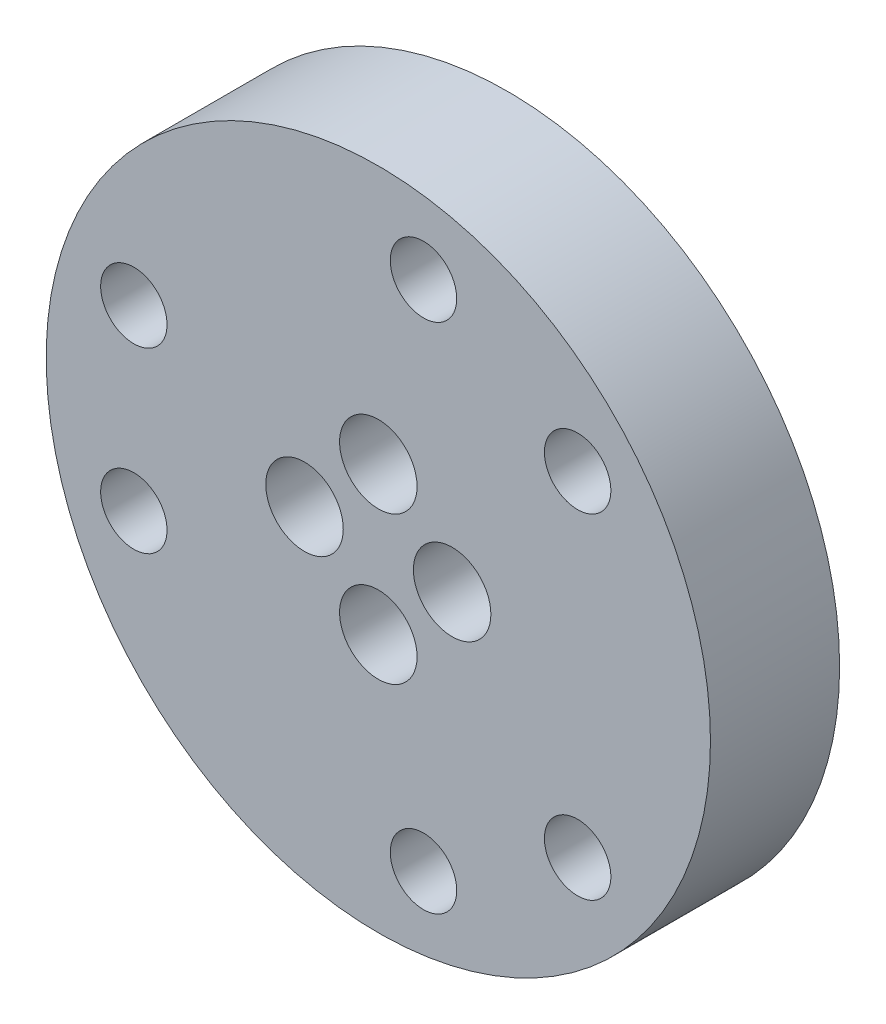
ISO-10303-21;
HEADER;
FILE_DESCRIPTION(('STEP AP214'),'2;1');
FILE_NAME('part.step','',(''),(''),'','','');
FILE_SCHEMA(('AUTOMOTIVE_DESIGN { 1 0 10303 214 1 1 1 1 }'));
ENDSEC;
DATA;
#1=APPLICATION_CONTEXT('core data for automotive mechanical design processes');
#2=APPLICATION_PROTOCOL_DEFINITION('international standard','automotive_design',2000,#1);
#3=PRODUCT_CONTEXT('',#1,'mechanical');
#4=PRODUCT('Part','Part','',(#3));
#5=PRODUCT_RELATED_PRODUCT_CATEGORY('part','',(#4));
#6=PRODUCT_DEFINITION_FORMATION('','',#4);
#7=PRODUCT_DEFINITION_CONTEXT('part definition',#1,'design');
#8=PRODUCT_DEFINITION('design','',#6,#7);
#9=PRODUCT_DEFINITION_SHAPE('','',#8);
#10=(LENGTH_UNIT() NAMED_UNIT(*) SI_UNIT(.MILLI.,.METRE.));
#11=(NAMED_UNIT(*) PLANE_ANGLE_UNIT() SI_UNIT($,.RADIAN.));
#12=(NAMED_UNIT(*) SI_UNIT($,.STERADIAN.) SOLID_ANGLE_UNIT());
#13=UNCERTAINTY_MEASURE_WITH_UNIT(LENGTH_MEASURE(1.E-05),#10,'distance_accuracy_value','');
#14=(GEOMETRIC_REPRESENTATION_CONTEXT(3) GLOBAL_UNCERTAINTY_ASSIGNED_CONTEXT((#13)) GLOBAL_UNIT_ASSIGNED_CONTEXT((#10,
#11,#12)) REPRESENTATION_CONTEXT('',''));
#15=CARTESIAN_POINT('',(0.,0.,0.));
#16=DIRECTION('',(0.,0.,1.));
#17=DIRECTION('',(1.,0.,0.));
#18=AXIS2_PLACEMENT_3D('',#15,#16,#17);
#19=CARTESIAN_POINT('',(0.,0.,0.));
#20=DIRECTION('',(0.,0.,1.));
#21=DIRECTION('',(1.,0.,0.));
#22=AXIS2_PLACEMENT_3D('',#19,#20,#21);
#23=PLANE('',#22);
#24=CARTESIAN_POINT('',(-13.2496659530813,4.82248402089194,0.));
#25=DIRECTION('',(0.,0.,-1.));
#26=DIRECTION('',(-1.,0.,0.));
#27=AXIS2_PLACEMENT_3D('',#24,#25,#26);
#28=CIRCLE('',#27,3.15);
#29=CARTESIAN_POINT('',(-16.3996659530813,4.82248402089194,0.));
#30=VERTEX_POINT('',#29);
#31=EDGE_CURVE('E203',#30,#30,#28,.T.);
#32=ORIENTED_EDGE('',*,*,#31,.F.);
#33=EDGE_LOOP('',(#32));
#34=FACE_BOUND('',#33,.T.);
#35=CARTESIAN_POINT('',(-4.,0.,0.));
#36=DIRECTION('',(0.,0.,1.));
#37=DIRECTION('',(1.,0.,0.));
#38=AXIS2_PLACEMENT_3D('',#35,#36,#37);
#39=CIRCLE('',#38,1.1);
#40=CARTESIAN_POINT('',(-2.9,0.,0.));
#41=VERTEX_POINT('',#40);
#42=EDGE_CURVE('E51',#41,#41,#39,.T.);
#43=ORIENTED_EDGE('',*,*,#42,.T.);
#44=EDGE_LOOP('',(#43));
#45=FACE_BOUND('',#44,.T.);
#46=CARTESIAN_POINT('',(0.,-4.,0.));
#47=DIRECTION('',(0.,0.,1.));
#48=DIRECTION('',(1.,0.,0.));
#49=AXIS2_PLACEMENT_3D('',#46,#47,#48);
#50=CIRCLE('',#49,1.1);
#51=CARTESIAN_POINT('',(1.1,-4.,0.));
#52=VERTEX_POINT('',#51);
#53=EDGE_CURVE('E74',#52,#52,#50,.T.);
#54=ORIENTED_EDGE('',*,*,#53,.T.);
#55=EDGE_LOOP('',(#54));
#56=FACE_BOUND('',#55,.T.);
#57=CARTESIAN_POINT('',(4.,0.,0.));
#58=DIRECTION('',(0.,0.,1.));
#59=DIRECTION('',(1.,0.,0.));
#60=AXIS2_PLACEMENT_3D('',#57,#58,#59);
#61=CIRCLE('',#60,1.1);
#62=CARTESIAN_POINT('',(5.1,0.,0.));
#63=VERTEX_POINT('',#62);
#64=EDGE_CURVE('E76',#63,#63,#61,.T.);
#65=ORIENTED_EDGE('',*,*,#64,.T.);
#66=EDGE_LOOP('',(#65));
#67=FACE_BOUND('',#66,.T.);
#68=CARTESIAN_POINT('',(0.,4.,0.));
#69=DIRECTION('',(0.,0.,1.));
#70=DIRECTION('',(1.,0.,0.));
#71=AXIS2_PLACEMENT_3D('',#68,#69,#70);
#72=CIRCLE('',#71,1.1);
#73=CARTESIAN_POINT('',(1.1,4.,0.));
#74=VERTEX_POINT('',#73);
#75=EDGE_CURVE('E43',#74,#74,#72,.T.);
#76=ORIENTED_EDGE('',*,*,#75,.T.);
#77=EDGE_LOOP('',(#76));
#78=FACE_BOUND('',#77,.T.);
#79=CARTESIAN_POINT('',(0.,0.,0.));
#80=DIRECTION('',(0.,0.,1.));
#81=DIRECTION('',(1.,0.,0.));
#82=AXIS2_PLACEMENT_3D('',#79,#80,#81);
#83=CIRCLE('',#82,18.);
#84=CARTESIAN_POINT('',(18.,0.,0.));
#85=VERTEX_POINT('',#84);
#86=EDGE_CURVE('E38',#85,#85,#83,.T.);
#87=ORIENTED_EDGE('',*,*,#86,.F.);
#88=EDGE_LOOP('',(#87));
#89=FACE_BOUND('',#88,.T.);
#90=CARTESIAN_POINT('',(10.8012266479773,9.06330529658191,0.));
#91=DIRECTION('',(0.,0.,-1.));
#92=DIRECTION('',(-1.,0.,0.));
#93=AXIS2_PLACEMENT_3D('',#90,#91,#92);
#94=CIRCLE('',#93,3.15);
#95=CARTESIAN_POINT('',(7.65122664797731,9.06330529658191,0.));
#96=VERTEX_POINT('',#95);
#97=EDGE_CURVE('E167',#96,#96,#94,.T.);
#98=ORIENTED_EDGE('',*,*,#97,.F.);
#99=EDGE_LOOP('',(#98));
#100=FACE_BOUND('',#99,.T.);
#101=CARTESIAN_POINT('',(10.8012266479789,-9.06330529657909,0.));
#102=DIRECTION('',(0.,0.,-1.));
#103=DIRECTION('',(-1.,0.,0.));
#104=AXIS2_PLACEMENT_3D('',#101,#102,#103);
#105=CIRCLE('',#104,3.15);
#106=CARTESIAN_POINT('',(7.65122664797894,-9.06330529657909,0.));
#107=VERTEX_POINT('',#106);
#108=EDGE_CURVE('E176',#107,#107,#105,.T.);
#109=ORIENTED_EDGE('',*,*,#108,.F.);
#110=EDGE_LOOP('',(#109));
#111=FACE_BOUND('',#110,.T.);
#112=CARTESIAN_POINT('',(2.44843930510505,-13.885789317471,0.));
#113=DIRECTION('',(0.,0.,-1.));
#114=DIRECTION('',(-1.,0.,0.));
#115=AXIS2_PLACEMENT_3D('',#112,#113,#114);
#116=CIRCLE('',#115,3.15);
#117=CARTESIAN_POINT('',(-0.701560694894948,-13.885789317471,0.));
#118=VERTEX_POINT('',#117);
#119=EDGE_CURVE('E185',#118,#118,#116,.T.);
#120=ORIENTED_EDGE('',*,*,#119,.F.);
#121=EDGE_LOOP('',(#120));
#122=FACE_BOUND('',#121,.T.);
#123=CARTESIAN_POINT('',(-13.2496659530813,-4.82248402089194,0.));
#124=DIRECTION('',(0.,0.,-1.));
#125=DIRECTION('',(-1.,0.,0.));
#126=AXIS2_PLACEMENT_3D('',#123,#124,#125);
#127=CIRCLE('',#126,3.15);
#128=CARTESIAN_POINT('',(-16.3996659530813,-4.82248402089194,0.));
#129=VERTEX_POINT('',#128);
#130=EDGE_CURVE('E194',#129,#129,#127,.T.);
#131=ORIENTED_EDGE('',*,*,#130,.F.);
#132=EDGE_LOOP('',(#131));
#133=FACE_BOUND('',#132,.T.);
#134=CARTESIAN_POINT('',(2.44843930510341,13.8857893174738,0.));
#135=DIRECTION('',(0.,0.,-1.));
#136=DIRECTION('',(-1.,0.,0.));
#137=AXIS2_PLACEMENT_3D('',#134,#135,#136);
#138=CIRCLE('',#137,3.15);
#139=CARTESIAN_POINT('',(-0.701560694896587,13.8857893174738,0.));
#140=VERTEX_POINT('',#139);
#141=EDGE_CURVE('E212',#140,#140,#138,.T.);
#142=ORIENTED_EDGE('',*,*,#141,.F.);
#143=EDGE_LOOP('',(#142));
#144=FACE_BOUND('',#143,.T.);
#145=ADVANCED_FACE('F30',(#34,#45,#56,#67,#78,#89,#100,#111,#122,#133,#144),#23,.F.);
#146=CARTESIAN_POINT('',(0.,0.,7.));
#147=DIRECTION('',(0.,0.,1.));
#148=DIRECTION('',(1.,0.,0.));
#149=AXIS2_PLACEMENT_3D('',#146,#147,#148);
#150=PLANE('',#149);
#151=CARTESIAN_POINT('',(2.44843930510341,13.8857893174738,7.00000000000001));
#152=DIRECTION('',(0.,0.,-1.));
#153=DIRECTION('',(-1.,0.,0.));
#154=AXIS2_PLACEMENT_3D('',#151,#152,#153);
#155=CIRCLE('',#154,1.79999999999999);
#156=CARTESIAN_POINT('',(0.648439305103426,13.8857893174738,7.00000000000001));
#157=VERTEX_POINT('',#156);
#158=EDGE_CURVE('E206',#157,#157,#155,.T.);
#159=ORIENTED_EDGE('',*,*,#158,.T.);
#160=EDGE_LOOP('',(#159));
#161=FACE_BOUND('',#160,.T.);
#162=CARTESIAN_POINT('',(0.,0.,7.));
#163=DIRECTION('',(0.,0.,1.));
#164=DIRECTION('',(1.,0.,0.));
#165=AXIS2_PLACEMENT_3D('',#162,#163,#164);
#166=CIRCLE('',#165,18.);
#167=CARTESIAN_POINT('',(18.,0.,7.));
#168=VERTEX_POINT('',#167);
#169=EDGE_CURVE('E10',#168,#168,#166,.T.);
#170=ORIENTED_EDGE('',*,*,#169,.T.);
#171=EDGE_LOOP('',(#170));
#172=FACE_BOUND('',#171,.T.);
#173=CARTESIAN_POINT('',(0.,4.,7.));
#174=DIRECTION('',(0.,0.,1.));
#175=DIRECTION('',(1.,0.,0.));
#176=AXIS2_PLACEMENT_3D('',#173,#174,#175);
#177=CIRCLE('',#176,2.1);
#178=CARTESIAN_POINT('',(2.1,4.,7.));
#179=VERTEX_POINT('',#178);
#180=EDGE_CURVE('E61',#179,#179,#177,.T.);
#181=ORIENTED_EDGE('',*,*,#180,.F.);
#182=EDGE_LOOP('',(#181));
#183=FACE_BOUND('',#182,.T.);
#184=CARTESIAN_POINT('',(0.,-4.,7.));
#185=DIRECTION('',(0.,0.,1.));
#186=DIRECTION('',(1.,0.,0.));
#187=AXIS2_PLACEMENT_3D('',#184,#185,#186);
#188=CIRCLE('',#187,2.1);
#189=CARTESIAN_POINT('',(2.1,-4.,7.));
#190=VERTEX_POINT('',#189);
#191=EDGE_CURVE('E154',#190,#190,#188,.T.);
#192=ORIENTED_EDGE('',*,*,#191,.F.);
#193=EDGE_LOOP('',(#192));
#194=FACE_BOUND('',#193,.T.);
#195=CARTESIAN_POINT('',(4.,0.,7.));
#196=DIRECTION('',(0.,0.,1.));
#197=DIRECTION('',(1.,0.,0.));
#198=AXIS2_PLACEMENT_3D('',#195,#196,#197);
#199=CIRCLE('',#198,2.1);
#200=CARTESIAN_POINT('',(6.1,0.,7.));
#201=VERTEX_POINT('',#200);
#202=EDGE_CURVE('E142',#201,#201,#199,.T.);
#203=ORIENTED_EDGE('',*,*,#202,.F.);
#204=EDGE_LOOP('',(#203));
#205=FACE_BOUND('',#204,.T.);
#206=CARTESIAN_POINT('',(-4.,0.,7.));
#207=DIRECTION('',(0.,0.,1.));
#208=DIRECTION('',(1.,0.,0.));
#209=AXIS2_PLACEMENT_3D('',#206,#207,#208);
#210=CIRCLE('',#209,2.1);
#211=CARTESIAN_POINT('',(-1.9,0.,7.));
#212=VERTEX_POINT('',#211);
#213=EDGE_CURVE('E143',#212,#212,#210,.T.);
#214=ORIENTED_EDGE('',*,*,#213,.F.);
#215=EDGE_LOOP('',(#214));
#216=FACE_BOUND('',#215,.T.);
#217=CARTESIAN_POINT('',(10.8012266479773,9.06330529658191,7.00000000000001));
#218=DIRECTION('',(0.,0.,-1.));
#219=DIRECTION('',(-1.,0.,0.));
#220=AXIS2_PLACEMENT_3D('',#217,#218,#219);
#221=CIRCLE('',#220,1.79999999999999);
#222=CARTESIAN_POINT('',(9.00122664797732,9.06330529658191,7.00000000000001));
#223=VERTEX_POINT('',#222);
#224=EDGE_CURVE('E149',#223,#223,#221,.T.);
#225=ORIENTED_EDGE('',*,*,#224,.T.);
#226=EDGE_LOOP('',(#225));
#227=FACE_BOUND('',#226,.T.);
#228=CARTESIAN_POINT('',(10.8012266479789,-9.06330529657909,7.00000000000001));
#229=DIRECTION('',(0.,0.,-1.));
#230=DIRECTION('',(-1.,0.,0.));
#231=AXIS2_PLACEMENT_3D('',#228,#229,#230);
#232=CIRCLE('',#231,1.79999999999999);
#233=CARTESIAN_POINT('',(9.00122664797895,-9.06330529657909,7.00000000000001));
#234=VERTEX_POINT('',#233);
#235=EDGE_CURVE('E170',#234,#234,#232,.T.);
#236=ORIENTED_EDGE('',*,*,#235,.T.);
#237=EDGE_LOOP('',(#236));
#238=FACE_BOUND('',#237,.T.);
#239=CARTESIAN_POINT('',(2.44843930510505,-13.885789317471,7.00000000000001));
#240=DIRECTION('',(0.,0.,-1.));
#241=DIRECTION('',(-1.,0.,0.));
#242=AXIS2_PLACEMENT_3D('',#239,#240,#241);
#243=CIRCLE('',#242,1.79999999999999);
#244=CARTESIAN_POINT('',(0.648439305105064,-13.885789317471,7.00000000000001));
#245=VERTEX_POINT('',#244);
#246=EDGE_CURVE('E179',#245,#245,#243,.T.);
#247=ORIENTED_EDGE('',*,*,#246,.T.);
#248=EDGE_LOOP('',(#247));
#249=FACE_BOUND('',#248,.T.);
#250=CARTESIAN_POINT('',(-13.2496659530813,-4.82248402089194,7.00000000000001));
#251=DIRECTION('',(0.,0.,-1.));
#252=DIRECTION('',(-1.,0.,0.));
#253=AXIS2_PLACEMENT_3D('',#250,#251,#252);
#254=CIRCLE('',#253,1.79999999999999);
#255=CARTESIAN_POINT('',(-15.0496659530813,-4.82248402089194,7.00000000000001));
#256=VERTEX_POINT('',#255);
#257=EDGE_CURVE('E188',#256,#256,#254,.T.);
#258=ORIENTED_EDGE('',*,*,#257,.T.);
#259=EDGE_LOOP('',(#258));
#260=FACE_BOUND('',#259,.T.);
#261=CARTESIAN_POINT('',(-13.2496659530813,4.82248402089194,7.00000000000001));
#262=DIRECTION('',(0.,0.,-1.));
#263=DIRECTION('',(-1.,0.,0.));
#264=AXIS2_PLACEMENT_3D('',#261,#262,#263);
#265=CIRCLE('',#264,1.79999999999999);
#266=CARTESIAN_POINT('',(-15.0496659530813,4.82248402089194,7.00000000000001));
#267=VERTEX_POINT('',#266);
#268=EDGE_CURVE('E197',#267,#267,#265,.T.);
#269=ORIENTED_EDGE('',*,*,#268,.T.);
#270=EDGE_LOOP('',(#269));
#271=FACE_BOUND('',#270,.T.);
#272=ADVANCED_FACE('F108',(#161,#172,#183,#194,#205,#216,#227,#238,#249,#260,#271),#150,.T.);
#273=CARTESIAN_POINT('',(4.,0.,7.));
#274=DIRECTION('',(0.,0.,-1.));
#275=DIRECTION('',(-1.,0.,0.));
#276=AXIS2_PLACEMENT_3D('',#273,#274,#275);
#277=CYLINDRICAL_SURFACE('',#276,1.1);
#278=ORIENTED_EDGE('',*,*,#64,.F.);
#279=EDGE_LOOP('',(#278));
#280=FACE_BOUND('',#279,.T.);
#281=CARTESIAN_POINT('',(4.,0.,1.4));
#282=DIRECTION('',(0.,0.,1.));
#283=DIRECTION('',(1.,0.,0.));
#284=AXIS2_PLACEMENT_3D('',#281,#282,#283);
#285=CIRCLE('',#284,1.1);
#286=CARTESIAN_POINT('',(5.1,0.,1.4));
#287=VERTEX_POINT('',#286);
#288=EDGE_CURVE('E34',#287,#287,#285,.T.);
#289=ORIENTED_EDGE('',*,*,#288,.T.);
#290=EDGE_LOOP('',(#289));
#291=FACE_BOUND('',#290,.T.);
#292=ADVANCED_FACE('F113',(#280,#291),#277,.F.);
#293=CARTESIAN_POINT('',(0.,-4.,7.));
#294=DIRECTION('',(0.,0.,-1.));
#295=DIRECTION('',(-1.,0.,0.));
#296=AXIS2_PLACEMENT_3D('',#293,#294,#295);
#297=CYLINDRICAL_SURFACE('',#296,1.1);
#298=ORIENTED_EDGE('',*,*,#53,.F.);
#299=EDGE_LOOP('',(#298));
#300=FACE_BOUND('',#299,.T.);
#301=CARTESIAN_POINT('',(0.,-4.,1.4));
#302=DIRECTION('',(0.,0.,1.));
#303=DIRECTION('',(1.,0.,0.));
#304=AXIS2_PLACEMENT_3D('',#301,#302,#303);
#305=CIRCLE('',#304,1.1);
#306=CARTESIAN_POINT('',(1.1,-4.,1.4));
#307=VERTEX_POINT('',#306);
#308=EDGE_CURVE('E55',#307,#307,#305,.T.);
#309=ORIENTED_EDGE('',*,*,#308,.T.);
#310=EDGE_LOOP('',(#309));
#311=FACE_BOUND('',#310,.T.);
#312=ADVANCED_FACE('F121',(#300,#311),#297,.F.);
#313=CARTESIAN_POINT('',(-4.,0.,7.));
#314=DIRECTION('',(0.,0.,-1.));
#315=DIRECTION('',(-1.,0.,0.));
#316=AXIS2_PLACEMENT_3D('',#313,#314,#315);
#317=CYLINDRICAL_SURFACE('',#316,1.1);
#318=ORIENTED_EDGE('',*,*,#42,.F.);
#319=EDGE_LOOP('',(#318));
#320=FACE_BOUND('',#319,.T.);
#321=CARTESIAN_POINT('',(-4.,0.,1.4));
#322=DIRECTION('',(0.,0.,1.));
#323=DIRECTION('',(1.,0.,0.));
#324=AXIS2_PLACEMENT_3D('',#321,#322,#323);
#325=CIRCLE('',#324,1.1);
#326=CARTESIAN_POINT('',(-2.9,0.,1.4));
#327=VERTEX_POINT('',#326);
#328=EDGE_CURVE('E53',#327,#327,#325,.T.);
#329=ORIENTED_EDGE('',*,*,#328,.T.);
#330=EDGE_LOOP('',(#329));
#331=FACE_BOUND('',#330,.T.);
#332=ADVANCED_FACE('F88',(#320,#331),#317,.F.);
#333=CARTESIAN_POINT('',(0.,4.,7.));
#334=DIRECTION('',(0.,0.,-1.));
#335=DIRECTION('',(-1.,0.,0.));
#336=AXIS2_PLACEMENT_3D('',#333,#334,#335);
#337=CYLINDRICAL_SURFACE('',#336,1.1);
#338=ORIENTED_EDGE('',*,*,#75,.F.);
#339=EDGE_LOOP('',(#338));
#340=FACE_BOUND('',#339,.T.);
#341=CARTESIAN_POINT('',(0.,4.,1.4));
#342=DIRECTION('',(0.,0.,1.));
#343=DIRECTION('',(1.,0.,0.));
#344=AXIS2_PLACEMENT_3D('',#341,#342,#343);
#345=CIRCLE('',#344,1.1);
#346=CARTESIAN_POINT('',(1.1,4.,1.4));
#347=VERTEX_POINT('',#346);
#348=EDGE_CURVE('E48',#347,#347,#345,.T.);
#349=ORIENTED_EDGE('',*,*,#348,.T.);
#350=EDGE_LOOP('',(#349));
#351=FACE_BOUND('',#350,.T.);
#352=ADVANCED_FACE('F85',(#340,#351),#337,.F.);
#353=CARTESIAN_POINT('',(0.,0.,7.));
#354=DIRECTION('',(0.,0.,-1.));
#355=DIRECTION('',(-1.,0.,0.));
#356=AXIS2_PLACEMENT_3D('',#353,#354,#355);
#357=CYLINDRICAL_SURFACE('',#356,18.);
#358=ORIENTED_EDGE('',*,*,#169,.F.);
#359=EDGE_LOOP('',(#358));
#360=FACE_BOUND('',#359,.T.);
#361=ORIENTED_EDGE('',*,*,#86,.T.);
#362=EDGE_LOOP('',(#361));
#363=FACE_BOUND('',#362,.T.);
#364=ADVANCED_FACE('F32',(#360,#363),#357,.T.);
#365=CARTESIAN_POINT('',(0.,4.,1.4));
#366=DIRECTION('',(0.,0.,1.));
#367=DIRECTION('',(1.,0.,0.));
#368=AXIS2_PLACEMENT_3D('',#365,#366,#367);
#369=CYLINDRICAL_SURFACE('',#368,2.1);
#370=CARTESIAN_POINT('',(0.,4.,1.4));
#371=DIRECTION('',(0.,0.,1.));
#372=DIRECTION('',(1.,0.,0.));
#373=AXIS2_PLACEMENT_3D('',#370,#371,#372);
#374=CIRCLE('',#373,2.1);
#375=CARTESIAN_POINT('',(2.1,4.,1.4));
#376=VERTEX_POINT('',#375);
#377=EDGE_CURVE('E52',#376,#376,#374,.T.);
#378=ORIENTED_EDGE('',*,*,#377,.F.);
#379=EDGE_LOOP('',(#378));
#380=FACE_BOUND('',#379,.T.);
#381=ORIENTED_EDGE('',*,*,#180,.T.);
#382=EDGE_LOOP('',(#381));
#383=FACE_BOUND('',#382,.T.);
#384=ADVANCED_FACE('F96',(#380,#383),#369,.F.);
#385=CARTESIAN_POINT('',(0.,4.,1.4));
#386=DIRECTION('',(0.,0.,1.));
#387=DIRECTION('',(1.,0.,0.));
#388=AXIS2_PLACEMENT_3D('',#385,#386,#387);
#389=PLANE('',#388);
#390=ORIENTED_EDGE('',*,*,#348,.F.);
#391=EDGE_LOOP('',(#390));
#392=FACE_BOUND('',#391,.T.);
#393=ORIENTED_EDGE('',*,*,#377,.T.);
#394=EDGE_LOOP('',(#393));
#395=FACE_BOUND('',#394,.T.);
#396=ADVANCED_FACE('F92',(#392,#395),#389,.T.);
#397=CARTESIAN_POINT('',(-4.,0.,1.4));
#398=DIRECTION('',(0.,0.,1.));
#399=DIRECTION('',(1.,0.,0.));
#400=AXIS2_PLACEMENT_3D('',#397,#398,#399);
#401=CYLINDRICAL_SURFACE('',#400,2.1);
#402=CARTESIAN_POINT('',(-4.,0.,1.4));
#403=DIRECTION('',(0.,0.,1.));
#404=DIRECTION('',(1.,0.,0.));
#405=AXIS2_PLACEMENT_3D('',#402,#403,#404);
#406=CIRCLE('',#405,2.1);
#407=CARTESIAN_POINT('',(-1.9,0.,1.4));
#408=VERTEX_POINT('',#407);
#409=EDGE_CURVE('E140',#408,#408,#406,.T.);
#410=ORIENTED_EDGE('',*,*,#409,.F.);
#411=EDGE_LOOP('',(#410));
#412=FACE_BOUND('',#411,.T.);
#413=ORIENTED_EDGE('',*,*,#213,.T.);
#414=EDGE_LOOP('',(#413));
#415=FACE_BOUND('',#414,.T.);
#416=ADVANCED_FACE('F95',(#412,#415),#401,.F.);
#417=CARTESIAN_POINT('',(-4.,0.,1.4));
#418=DIRECTION('',(0.,0.,1.));
#419=DIRECTION('',(1.,0.,0.));
#420=AXIS2_PLACEMENT_3D('',#417,#418,#419);
#421=PLANE('',#420);
#422=ORIENTED_EDGE('',*,*,#328,.F.);
#423=EDGE_LOOP('',(#422));
#424=FACE_BOUND('',#423,.T.);
#425=ORIENTED_EDGE('',*,*,#409,.T.);
#426=EDGE_LOOP('',(#425));
#427=FACE_BOUND('',#426,.T.);
#428=ADVANCED_FACE('F133',(#424,#427),#421,.T.);
#429=CARTESIAN_POINT('',(0.,-4.,1.4));
#430=DIRECTION('',(0.,0.,1.));
#431=DIRECTION('',(1.,0.,0.));
#432=AXIS2_PLACEMENT_3D('',#429,#430,#431);
#433=CYLINDRICAL_SURFACE('',#432,2.1);
#434=CARTESIAN_POINT('',(0.,-4.,1.4));
#435=DIRECTION('',(0.,0.,1.));
#436=DIRECTION('',(1.,0.,0.));
#437=AXIS2_PLACEMENT_3D('',#434,#435,#436);
#438=CIRCLE('',#437,2.1);
#439=CARTESIAN_POINT('',(2.1,-4.,1.4));
#440=VERTEX_POINT('',#439);
#441=EDGE_CURVE('E56',#440,#440,#438,.T.);
#442=ORIENTED_EDGE('',*,*,#441,.F.);
#443=EDGE_LOOP('',(#442));
#444=FACE_BOUND('',#443,.T.);
#445=ORIENTED_EDGE('',*,*,#191,.T.);
#446=EDGE_LOOP('',(#445));
#447=FACE_BOUND('',#446,.T.);
#448=ADVANCED_FACE('F136',(#444,#447),#433,.F.);
#449=CARTESIAN_POINT('',(0.,-4.,1.4));
#450=DIRECTION('',(0.,0.,1.));
#451=DIRECTION('',(1.,0.,0.));
#452=AXIS2_PLACEMENT_3D('',#449,#450,#451);
#453=PLANE('',#452);
#454=ORIENTED_EDGE('',*,*,#308,.F.);
#455=EDGE_LOOP('',(#454));
#456=FACE_BOUND('',#455,.T.);
#457=ORIENTED_EDGE('',*,*,#441,.T.);
#458=EDGE_LOOP('',(#457));
#459=FACE_BOUND('',#458,.T.);
#460=ADVANCED_FACE('F275',(#456,#459),#453,.T.);
#461=CARTESIAN_POINT('',(4.,0.,1.4));
#462=DIRECTION('',(0.,0.,1.));
#463=DIRECTION('',(1.,0.,0.));
#464=AXIS2_PLACEMENT_3D('',#461,#462,#463);
#465=CYLINDRICAL_SURFACE('',#464,2.1);
#466=CARTESIAN_POINT('',(4.,0.,1.4));
#467=DIRECTION('',(0.,0.,1.));
#468=DIRECTION('',(1.,0.,0.));
#469=AXIS2_PLACEMENT_3D('',#466,#467,#468);
#470=CIRCLE('',#469,2.1);
#471=CARTESIAN_POINT('',(6.1,0.,1.4));
#472=VERTEX_POINT('',#471);
#473=EDGE_CURVE('E146',#472,#472,#470,.T.);
#474=ORIENTED_EDGE('',*,*,#473,.F.);
#475=EDGE_LOOP('',(#474));
#476=FACE_BOUND('',#475,.T.);
#477=ORIENTED_EDGE('',*,*,#202,.T.);
#478=EDGE_LOOP('',(#477));
#479=FACE_BOUND('',#478,.T.);
#480=ADVANCED_FACE('F272',(#476,#479),#465,.F.);
#481=CARTESIAN_POINT('',(4.,0.,1.4));
#482=DIRECTION('',(0.,0.,1.));
#483=DIRECTION('',(1.,0.,0.));
#484=AXIS2_PLACEMENT_3D('',#481,#482,#483);
#485=PLANE('',#484);
#486=ORIENTED_EDGE('',*,*,#288,.F.);
#487=EDGE_LOOP('',(#486));
#488=FACE_BOUND('',#487,.T.);
#489=ORIENTED_EDGE('',*,*,#473,.T.);
#490=EDGE_LOOP('',(#489));
#491=FACE_BOUND('',#490,.T.);
#492=ADVANCED_FACE('F268',(#488,#491),#485,.T.);
#493=CARTESIAN_POINT('',(10.8012266479773,9.06330529658191,0.));
#494=DIRECTION('',(0.,0.,-1.));
#495=DIRECTION('',(-1.,0.,0.));
#496=AXIS2_PLACEMENT_3D('',#493,#494,#495);
#497=CYLINDRICAL_SURFACE('',#496,1.79999999999999);
#498=ORIENTED_EDGE('',*,*,#224,.F.);
#499=EDGE_LOOP('',(#498));
#500=FACE_BOUND('',#499,.T.);
#501=CARTESIAN_POINT('',(10.8012266479773,9.06330529658191,1.35));
#502=DIRECTION('',(0.,0.,-1.));
#503=DIRECTION('',(-1.,0.,0.));
#504=AXIS2_PLACEMENT_3D('',#501,#502,#503);
#505=CIRCLE('',#504,1.79999999999999);
#506=CARTESIAN_POINT('',(9.00122664797732,9.06330529658191,1.35));
#507=VERTEX_POINT('',#506);
#508=EDGE_CURVE('E164',#507,#507,#505,.T.);
#509=ORIENTED_EDGE('',*,*,#508,.T.);
#510=EDGE_LOOP('',(#509));
#511=FACE_BOUND('',#510,.T.);
#512=ADVANCED_FACE('F264',(#500,#511),#497,.F.);
#513=CARTESIAN_POINT('',(10.8012266479773,9.06330529658191,0.));
#514=DIRECTION('',(0.,0.,-1.));
#515=DIRECTION('',(-1.,0.,0.));
#516=AXIS2_PLACEMENT_3D('',#513,#514,#515);
#517=CONICAL_SURFACE('',#516,3.15,0.785398163397451);
#518=ORIENTED_EDGE('',*,*,#508,.F.);
#519=EDGE_LOOP('',(#518));
#520=FACE_BOUND('',#519,.T.);
#521=ORIENTED_EDGE('',*,*,#97,.T.);
#522=EDGE_LOOP('',(#521));
#523=FACE_BOUND('',#522,.T.);
#524=ADVANCED_FACE('F260',(#520,#523),#517,.F.);
#525=CARTESIAN_POINT('',(10.8012266479789,-9.06330529657909,0.));
#526=DIRECTION('',(0.,0.,-1.));
#527=DIRECTION('',(-1.,0.,0.));
#528=AXIS2_PLACEMENT_3D('',#525,#526,#527);
#529=CYLINDRICAL_SURFACE('',#528,1.79999999999999);
#530=ORIENTED_EDGE('',*,*,#235,.F.);
#531=EDGE_LOOP('',(#530));
#532=FACE_BOUND('',#531,.T.);
#533=CARTESIAN_POINT('',(10.8012266479789,-9.06330529657909,1.35));
#534=DIRECTION('',(0.,0.,-1.));
#535=DIRECTION('',(-1.,0.,0.));
#536=AXIS2_PLACEMENT_3D('',#533,#534,#535);
#537=CIRCLE('',#536,1.79999999999999);
#538=CARTESIAN_POINT('',(9.00122664797895,-9.06330529657909,1.35));
#539=VERTEX_POINT('',#538);
#540=EDGE_CURVE('E173',#539,#539,#537,.T.);
#541=ORIENTED_EDGE('',*,*,#540,.T.);
#542=EDGE_LOOP('',(#541));
#543=FACE_BOUND('',#542,.T.);
#544=ADVANCED_FACE('F256',(#532,#543),#529,.F.);
#545=CARTESIAN_POINT('',(10.8012266479789,-9.06330529657909,0.));
#546=DIRECTION('',(0.,0.,-1.));
#547=DIRECTION('',(-1.,0.,0.));
#548=AXIS2_PLACEMENT_3D('',#545,#546,#547);
#549=CONICAL_SURFACE('',#548,3.15,0.785398163397451);
#550=ORIENTED_EDGE('',*,*,#540,.F.);
#551=EDGE_LOOP('',(#550));
#552=FACE_BOUND('',#551,.T.);
#553=ORIENTED_EDGE('',*,*,#108,.T.);
#554=EDGE_LOOP('',(#553));
#555=FACE_BOUND('',#554,.T.);
#556=ADVANCED_FACE('F252',(#552,#555),#549,.F.);
#557=CARTESIAN_POINT('',(2.44843930510505,-13.885789317471,0.));
#558=DIRECTION('',(0.,0.,-1.));
#559=DIRECTION('',(-1.,0.,0.));
#560=AXIS2_PLACEMENT_3D('',#557,#558,#559);
#561=CYLINDRICAL_SURFACE('',#560,1.79999999999999);
#562=ORIENTED_EDGE('',*,*,#246,.F.);
#563=EDGE_LOOP('',(#562));
#564=FACE_BOUND('',#563,.T.);
#565=CARTESIAN_POINT('',(2.44843930510505,-13.885789317471,1.35));
#566=DIRECTION('',(0.,0.,-1.));
#567=DIRECTION('',(-1.,0.,0.));
#568=AXIS2_PLACEMENT_3D('',#565,#566,#567);
#569=CIRCLE('',#568,1.79999999999999);
#570=CARTESIAN_POINT('',(0.648439305105064,-13.885789317471,1.35));
#571=VERTEX_POINT('',#570);
#572=EDGE_CURVE('E182',#571,#571,#569,.T.);
#573=ORIENTED_EDGE('',*,*,#572,.T.);
#574=EDGE_LOOP('',(#573));
#575=FACE_BOUND('',#574,.T.);
#576=ADVANCED_FACE('F248',(#564,#575),#561,.F.);
#577=CARTESIAN_POINT('',(2.44843930510505,-13.885789317471,0.));
#578=DIRECTION('',(0.,0.,-1.));
#579=DIRECTION('',(-1.,0.,0.));
#580=AXIS2_PLACEMENT_3D('',#577,#578,#579);
#581=CONICAL_SURFACE('',#580,3.15,0.785398163397451);
#582=ORIENTED_EDGE('',*,*,#572,.F.);
#583=EDGE_LOOP('',(#582));
#584=FACE_BOUND('',#583,.T.);
#585=ORIENTED_EDGE('',*,*,#119,.T.);
#586=EDGE_LOOP('',(#585));
#587=FACE_BOUND('',#586,.T.);
#588=ADVANCED_FACE('F244',(#584,#587),#581,.F.);
#589=CARTESIAN_POINT('',(-13.2496659530813,-4.82248402089194,0.));
#590=DIRECTION('',(0.,0.,-1.));
#591=DIRECTION('',(-1.,0.,0.));
#592=AXIS2_PLACEMENT_3D('',#589,#590,#591);
#593=CYLINDRICAL_SURFACE('',#592,1.79999999999999);
#594=ORIENTED_EDGE('',*,*,#257,.F.);
#595=EDGE_LOOP('',(#594));
#596=FACE_BOUND('',#595,.T.);
#597=CARTESIAN_POINT('',(-13.2496659530813,-4.82248402089194,1.35));
#598=DIRECTION('',(0.,0.,-1.));
#599=DIRECTION('',(-1.,0.,0.));
#600=AXIS2_PLACEMENT_3D('',#597,#598,#599);
#601=CIRCLE('',#600,1.79999999999999);
#602=CARTESIAN_POINT('',(-15.0496659530813,-4.82248402089194,1.35));
#603=VERTEX_POINT('',#602);
#604=EDGE_CURVE('E191',#603,#603,#601,.T.);
#605=ORIENTED_EDGE('',*,*,#604,.T.);
#606=EDGE_LOOP('',(#605));
#607=FACE_BOUND('',#606,.T.);
#608=ADVANCED_FACE('F240',(#596,#607),#593,.F.);
#609=CARTESIAN_POINT('',(-13.2496659530813,-4.82248402089194,0.));
#610=DIRECTION('',(0.,0.,-1.));
#611=DIRECTION('',(-1.,0.,0.));
#612=AXIS2_PLACEMENT_3D('',#609,#610,#611);
#613=CONICAL_SURFACE('',#612,3.15,0.785398163397451);
#614=ORIENTED_EDGE('',*,*,#604,.F.);
#615=EDGE_LOOP('',(#614));
#616=FACE_BOUND('',#615,.T.);
#617=ORIENTED_EDGE('',*,*,#130,.T.);
#618=EDGE_LOOP('',(#617));
#619=FACE_BOUND('',#618,.T.);
#620=ADVANCED_FACE('F236',(#616,#619),#613,.F.);
#621=CARTESIAN_POINT('',(-13.2496659530813,4.82248402089194,0.));
#622=DIRECTION('',(0.,0.,-1.));
#623=DIRECTION('',(-1.,0.,0.));
#624=AXIS2_PLACEMENT_3D('',#621,#622,#623);
#625=CYLINDRICAL_SURFACE('',#624,1.79999999999999);
#626=ORIENTED_EDGE('',*,*,#268,.F.);
#627=EDGE_LOOP('',(#626));
#628=FACE_BOUND('',#627,.T.);
#629=CARTESIAN_POINT('',(-13.2496659530813,4.82248402089194,1.35));
#630=DIRECTION('',(0.,0.,-1.));
#631=DIRECTION('',(-1.,0.,0.));
#632=AXIS2_PLACEMENT_3D('',#629,#630,#631);
#633=CIRCLE('',#632,1.79999999999999);
#634=CARTESIAN_POINT('',(-15.0496659530813,4.82248402089194,1.35));
#635=VERTEX_POINT('',#634);
#636=EDGE_CURVE('E200',#635,#635,#633,.T.);
#637=ORIENTED_EDGE('',*,*,#636,.T.);
#638=EDGE_LOOP('',(#637));
#639=FACE_BOUND('',#638,.T.);
#640=ADVANCED_FACE('F232',(#628,#639),#625,.F.);
#641=CARTESIAN_POINT('',(-13.2496659530813,4.82248402089194,0.));
#642=DIRECTION('',(0.,0.,-1.));
#643=DIRECTION('',(-1.,0.,0.));
#644=AXIS2_PLACEMENT_3D('',#641,#642,#643);
#645=CONICAL_SURFACE('',#644,3.15,0.785398163397451);
#646=ORIENTED_EDGE('',*,*,#636,.F.);
#647=EDGE_LOOP('',(#646));
#648=FACE_BOUND('',#647,.T.);
#649=ORIENTED_EDGE('',*,*,#31,.T.);
#650=EDGE_LOOP('',(#649));
#651=FACE_BOUND('',#650,.T.);
#652=ADVANCED_FACE('F225',(#648,#651),#645,.F.);
#653=CARTESIAN_POINT('',(2.44843930510341,13.8857893174738,0.));
#654=DIRECTION('',(0.,0.,-1.));
#655=DIRECTION('',(-1.,0.,0.));
#656=AXIS2_PLACEMENT_3D('',#653,#654,#655);
#657=CYLINDRICAL_SURFACE('',#656,1.79999999999999);
#658=ORIENTED_EDGE('',*,*,#158,.F.);
#659=EDGE_LOOP('',(#658));
#660=FACE_BOUND('',#659,.T.);
#661=CARTESIAN_POINT('',(2.44843930510341,13.8857893174738,1.35));
#662=DIRECTION('',(0.,0.,-1.));
#663=DIRECTION('',(-1.,0.,0.));
#664=AXIS2_PLACEMENT_3D('',#661,#662,#663);
#665=CIRCLE('',#664,1.79999999999999);
#666=CARTESIAN_POINT('',(0.648439305103426,13.8857893174738,1.35));
#667=VERTEX_POINT('',#666);
#668=EDGE_CURVE('E209',#667,#667,#665,.T.);
#669=ORIENTED_EDGE('',*,*,#668,.T.);
#670=EDGE_LOOP('',(#669));
#671=FACE_BOUND('',#670,.T.);
#672=ADVANCED_FACE('F219',(#660,#671),#657,.F.);
#673=CARTESIAN_POINT('',(2.44843930510341,13.8857893174738,0.));
#674=DIRECTION('',(0.,0.,-1.));
#675=DIRECTION('',(-1.,0.,0.));
#676=AXIS2_PLACEMENT_3D('',#673,#674,#675);
#677=CONICAL_SURFACE('',#676,3.15,0.785398163397451);
#678=ORIENTED_EDGE('',*,*,#668,.F.);
#679=EDGE_LOOP('',(#678));
#680=FACE_BOUND('',#679,.T.);
#681=ORIENTED_EDGE('',*,*,#141,.T.);
#682=EDGE_LOOP('',(#681));
#683=FACE_BOUND('',#682,.T.);
#684=ADVANCED_FACE('F216',(#680,#683),#677,.F.);
#685=CLOSED_SHELL('',(#145,#272,#292,#312,#332,#352,#364,#384,#396,#416,#428,#448,#460,#480,
#492,#512,#524,#544,#556,#576,#588,#608,#620,#640,#652,#672,#684));
#686=MANIFOLD_SOLID_BREP('B2',#685);
#687=ADVANCED_BREP_SHAPE_REPRESENTATION('',(#18,#686),#14);
#688=SHAPE_DEFINITION_REPRESENTATION(#9,#687);
ENDSEC;
END-ISO-10303-21;
